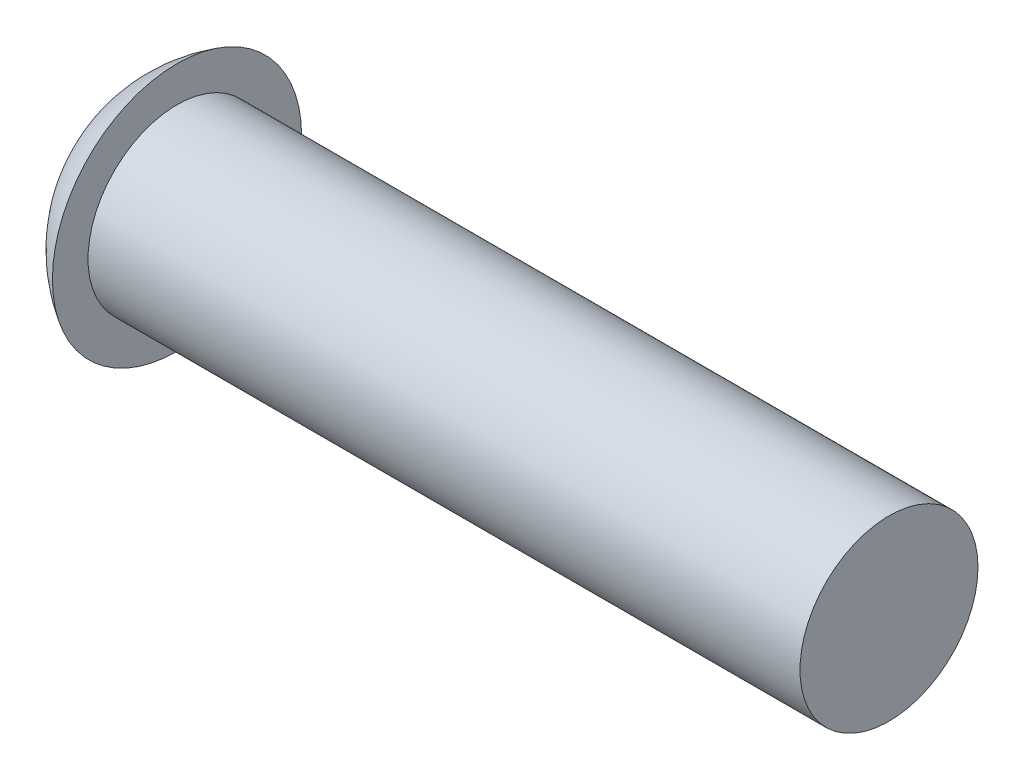
ISO-10303-21;
HEADER;
FILE_DESCRIPTION(('STEP AP214'),'2;1');
FILE_NAME('part.step','',(''),(''),'','','');
FILE_SCHEMA(('AUTOMOTIVE_DESIGN { 1 0 10303 214 1 1 1 1 }'));
ENDSEC;
DATA;
#1=APPLICATION_CONTEXT('core data for automotive mechanical design processes');
#2=APPLICATION_PROTOCOL_DEFINITION('international standard','automotive_design',2000,#1);
#3=PRODUCT_CONTEXT('',#1,'mechanical');
#4=PRODUCT('Part','Part','',(#3));
#5=PRODUCT_RELATED_PRODUCT_CATEGORY('part','',(#4));
#6=PRODUCT_DEFINITION_FORMATION('','',#4);
#7=PRODUCT_DEFINITION_CONTEXT('part definition',#1,'design');
#8=PRODUCT_DEFINITION('design','',#6,#7);
#9=PRODUCT_DEFINITION_SHAPE('','',#8);
#10=(LENGTH_UNIT() NAMED_UNIT(*) SI_UNIT(.MILLI.,.METRE.));
#11=(NAMED_UNIT(*) PLANE_ANGLE_UNIT() SI_UNIT($,.RADIAN.));
#12=(NAMED_UNIT(*) SI_UNIT($,.STERADIAN.) SOLID_ANGLE_UNIT());
#13=UNCERTAINTY_MEASURE_WITH_UNIT(LENGTH_MEASURE(1.E-05),#10,'distance_accuracy_value','');
#14=(GEOMETRIC_REPRESENTATION_CONTEXT(3) GLOBAL_UNCERTAINTY_ASSIGNED_CONTEXT((#13)) GLOBAL_UNIT_ASSIGNED_CONTEXT((#10,
#11,#12)) REPRESENTATION_CONTEXT('',''));
#15=CARTESIAN_POINT('',(0.,0.,0.));
#16=DIRECTION('',(0.,0.,1.));
#17=DIRECTION('',(1.,0.,0.));
#18=AXIS2_PLACEMENT_3D('',#15,#16,#17);
#19=CARTESIAN_POINT('',(110.,0.,0.));
#20=DIRECTION('',(1.,0.,0.));
#21=DIRECTION('',(0.,0.,-1.));
#22=AXIS2_PLACEMENT_3D('',#19,#20,#21);
#23=PLANE('',#22);
#24=CARTESIAN_POINT('',(110.,0.,0.));
#25=DIRECTION('',(1.,0.,0.));
#26=DIRECTION('',(0.,0.,-1.));
#27=AXIS2_PLACEMENT_3D('',#24,#25,#26);
#28=CIRCLE('',#27,12.5);
#29=CARTESIAN_POINT('',(110.,0.,-12.5));
#30=VERTEX_POINT('',#29);
#31=EDGE_CURVE('E10',#30,#30,#28,.T.);
#32=ORIENTED_EDGE('',*,*,#31,.T.);
#33=EDGE_LOOP('',(#32));
#34=FACE_BOUND('',#33,.T.);
#35=ADVANCED_FACE('F33',(#34),#23,.T.);
#36=CARTESIAN_POINT('',(110.,0.,0.));
#37=DIRECTION('',(1.,0.,0.));
#38=DIRECTION('',(0.,0.,-1.));
#39=AXIS2_PLACEMENT_3D('',#36,#37,#38);
#40=CYLINDRICAL_SURFACE('',#39,12.5);
#41=CARTESIAN_POINT('',(9.99999999999999,0.,0.));
#42=DIRECTION('',(1.,0.,0.));
#43=DIRECTION('',(0.,0.,-1.));
#44=AXIS2_PLACEMENT_3D('',#41,#42,#43);
#45=CIRCLE('',#44,12.5);
#46=CARTESIAN_POINT('',(9.99999999999999,0.,-12.5));
#47=VERTEX_POINT('',#46);
#48=EDGE_CURVE('E39',#47,#47,#45,.T.);
#49=ORIENTED_EDGE('',*,*,#48,.T.);
#50=EDGE_LOOP('',(#49));
#51=FACE_BOUND('',#50,.T.);
#52=ORIENTED_EDGE('',*,*,#31,.F.);
#53=EDGE_LOOP('',(#52));
#54=FACE_BOUND('',#53,.T.);
#55=ADVANCED_FACE('F59',(#51,#54),#40,.T.);
#56=CARTESIAN_POINT('',(10.,0.,-12.5));
#57=DIRECTION('',(1.,0.,0.));
#58=DIRECTION('',(0.,0.,-1.));
#59=AXIS2_PLACEMENT_3D('',#56,#57,#58);
#60=PLANE('',#59);
#61=CARTESIAN_POINT('',(10.,0.,0.));
#62=DIRECTION('',(1.,0.,0.));
#63=DIRECTION('',(0.,0.,-1.));
#64=AXIS2_PLACEMENT_3D('',#61,#62,#63);
#65=CIRCLE('',#64,17.5);
#66=CARTESIAN_POINT('',(10.,0.,-17.5));
#67=VERTEX_POINT('',#66);
#68=EDGE_CURVE('E43',#67,#67,#65,.T.);
#69=ORIENTED_EDGE('',*,*,#68,.T.);
#70=EDGE_LOOP('',(#69));
#71=FACE_BOUND('',#70,.T.);
#72=ORIENTED_EDGE('',*,*,#48,.F.);
#73=EDGE_LOOP('',(#72));
#74=FACE_BOUND('',#73,.T.);
#75=ADVANCED_FACE('F50',(#71,#74),#60,.T.);
#76=CARTESIAN_POINT('',(20.3125,0.,0.));
#77=DIRECTION('',(1.,0.,0.));
#78=DIRECTION('',(0.,0.,-1.));
#79=AXIS2_PLACEMENT_3D('',#76,#77,#78);
#80=SPHERICAL_SURFACE('',#79,20.3125);
#81=ORIENTED_EDGE('',*,*,#68,.F.);
#82=EDGE_LOOP('',(#81));
#83=FACE_BOUND('',#82,.T.);
#84=ADVANCED_FACE('F53',(#83),#80,.T.);
#85=CLOSED_SHELL('',(#35,#55,#75,#84));
#86=MANIFOLD_SOLID_BREP('B2',#85);
#87=ADVANCED_BREP_SHAPE_REPRESENTATION('',(#18,#86),#14);
#88=SHAPE_DEFINITION_REPRESENTATION(#9,#87);
ENDSEC;
END-ISO-10303-21;
